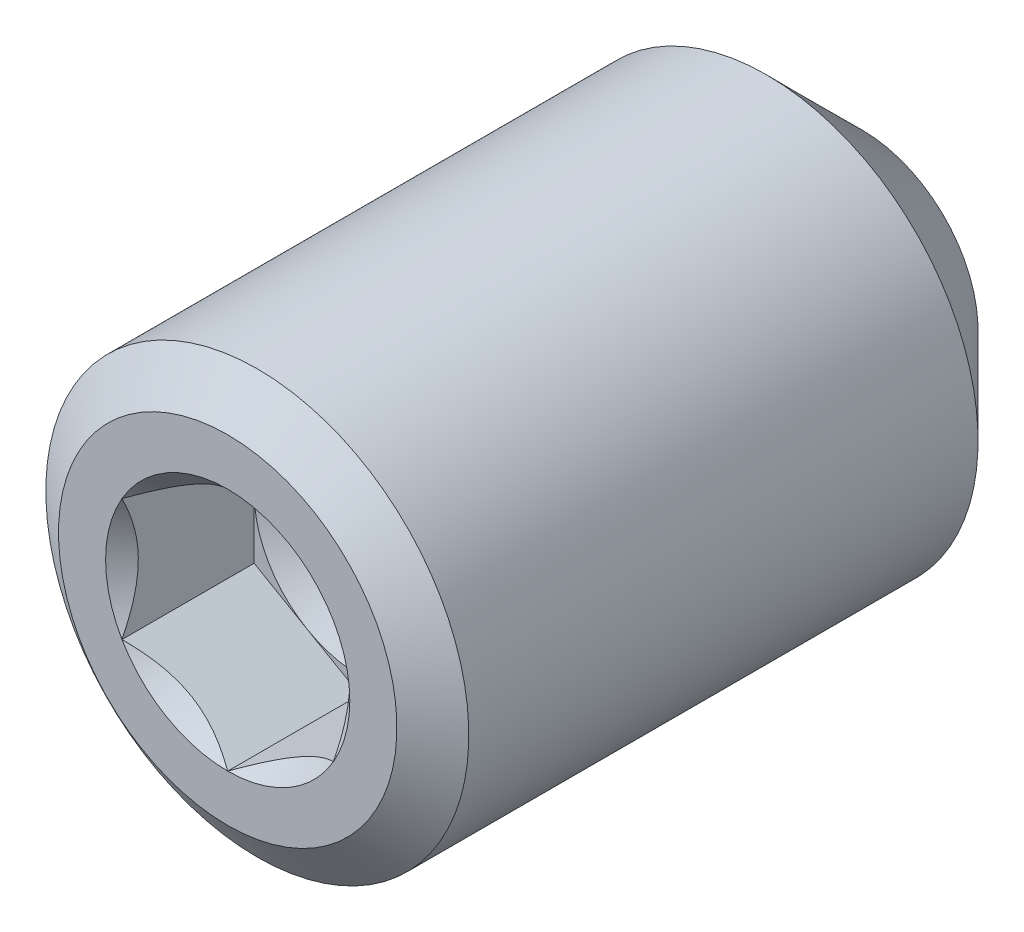
ISO-10303-21;
HEADER;
FILE_DESCRIPTION(('STEP AP214'),'2;1');
FILE_NAME('part.step','',(''),(''),'','','');
FILE_SCHEMA(('AUTOMOTIVE_DESIGN { 1 0 10303 214 1 1 1 1 }'));
ENDSEC;
DATA;
#1=APPLICATION_CONTEXT('core data for automotive mechanical design processes');
#2=APPLICATION_PROTOCOL_DEFINITION('international standard','automotive_design',2000,#1);
#3=PRODUCT_CONTEXT('',#1,'mechanical');
#4=PRODUCT('Part','Part','',(#3));
#5=PRODUCT_RELATED_PRODUCT_CATEGORY('part','',(#4));
#6=PRODUCT_DEFINITION_FORMATION('','',#4);
#7=PRODUCT_DEFINITION_CONTEXT('part definition',#1,'design');
#8=PRODUCT_DEFINITION('design','',#6,#7);
#9=PRODUCT_DEFINITION_SHAPE('','',#8);
#10=(LENGTH_UNIT() NAMED_UNIT(*) SI_UNIT(.MILLI.,.METRE.));
#11=(NAMED_UNIT(*) PLANE_ANGLE_UNIT() SI_UNIT($,.RADIAN.));
#12=(NAMED_UNIT(*) SI_UNIT($,.STERADIAN.) SOLID_ANGLE_UNIT());
#13=UNCERTAINTY_MEASURE_WITH_UNIT(LENGTH_MEASURE(1.E-05),#10,'distance_accuracy_value','');
#14=(GEOMETRIC_REPRESENTATION_CONTEXT(3) GLOBAL_UNCERTAINTY_ASSIGNED_CONTEXT((#13)) GLOBAL_UNIT_ASSIGNED_CONTEXT((#10,
#11,#12)) REPRESENTATION_CONTEXT('',''));
#15=CARTESIAN_POINT('',(0.,0.,0.));
#16=DIRECTION('',(0.,0.,1.));
#17=DIRECTION('',(1.,0.,0.));
#18=AXIS2_PLACEMENT_3D('',#15,#16,#17);
#19=CARTESIAN_POINT('',(-1.5875,2.74963065701559,2.25543977917698));
#20=DIRECTION('',(0.,0.,1.));
#21=DIRECTION('',(1.,0.,0.));
#22=AXIS2_PLACEMENT_3D('',#19,#20,#21);
#23=PLANE('',#22);
#24=CARTESIAN_POINT('',(0.,0.,2.25543977917698));
#25=DIRECTION('',(0.,0.,1.));
#26=DIRECTION('',(1.,0.,0.));
#27=AXIS2_PLACEMENT_3D('',#24,#25,#26);
#28=CIRCLE('',#27,1.5875);
#29=CARTESIAN_POINT('',(1.5875,0.,2.25543977917698));
#30=VERTEX_POINT('',#29);
#31=CARTESIAN_POINT('',(0.79375,1.37481532850779,2.25543977917698));
#32=VERTEX_POINT('',#31);
#33=EDGE_CURVE('E124',#30,#32,#28,.T.);
#34=ORIENTED_EDGE('',*,*,#33,.F.);
#35=DIRECTION('',(0.,1.,0.));
#36=VECTOR('',#35,1.);
#37=CARTESIAN_POINT('',(1.5875,-0.916543552338536,2.25543977917698));
#38=LINE('',#37,#36);
#39=CARTESIAN_POINT('',(1.5875,0.916543552338528,2.25543977917698));
#40=VERTEX_POINT('',#39);
#41=EDGE_CURVE('E150',#30,#40,#38,.T.);
#42=ORIENTED_EDGE('',*,*,#41,.T.);
#43=DIRECTION('',(-0.866025403784439,0.5,0.));
#44=VECTOR('',#43,1.);
#45=CARTESIAN_POINT('',(1.5875,0.916543552338528,2.25543977917698));
#46=LINE('',#45,#44);
#47=EDGE_CURVE('E145',#40,#32,#46,.T.);
#48=ORIENTED_EDGE('',*,*,#47,.T.);
#49=EDGE_LOOP('',(#34,#42,#48));
#50=FACE_BOUND('',#49,.T.);
#51=ADVANCED_FACE('F37',(#50),#23,.T.);
#52=CARTESIAN_POINT('',(-0.79375,1.37481532850779,2.25543977917698));
#53=VERTEX_POINT('',#52);
#54=EDGE_CURVE('E126',#32,#53,#28,.T.);
#55=ORIENTED_EDGE('',*,*,#54,.F.);
#56=CARTESIAN_POINT('',(0.,1.83308710467706,2.25543977917698));
#57=VERTEX_POINT('',#56);
#58=EDGE_CURVE('E137',#32,#57,#46,.T.);
#59=ORIENTED_EDGE('',*,*,#58,.T.);
#60=DIRECTION('',(-0.866025403784439,-0.5,0.));
#61=VECTOR('',#60,1.);
#62=CARTESIAN_POINT('',(0.,1.83308710467706,2.25543977917698));
#63=LINE('',#62,#61);
#64=EDGE_CURVE('E140',#57,#53,#63,.T.);
#65=ORIENTED_EDGE('',*,*,#64,.T.);
#66=EDGE_LOOP('',(#55,#59,#65));
#67=FACE_BOUND('',#66,.T.);
#68=ADVANCED_FACE('F136',(#67),#23,.T.);
#69=CARTESIAN_POINT('',(-1.5875,0.,2.25543977917698));
#70=VERTEX_POINT('',#69);
#71=EDGE_CURVE('E141',#53,#70,#28,.T.);
#72=ORIENTED_EDGE('',*,*,#71,.F.);
#73=CARTESIAN_POINT('',(-1.5875,0.916543552338527,2.25543977917698));
#74=VERTEX_POINT('',#73);
#75=EDGE_CURVE('E152',#53,#74,#63,.T.);
#76=ORIENTED_EDGE('',*,*,#75,.T.);
#77=DIRECTION('',(0.,-1.,0.));
#78=VECTOR('',#77,1.);
#79=CARTESIAN_POINT('',(-1.5875,0.916543552338527,2.25543977917698));
#80=LINE('',#79,#78);
#81=EDGE_CURVE('E163',#74,#70,#80,.T.);
#82=ORIENTED_EDGE('',*,*,#81,.T.);
#83=EDGE_LOOP('',(#72,#76,#82));
#84=FACE_BOUND('',#83,.T.);
#85=ADVANCED_FACE('F238',(#84),#23,.T.);
#86=CARTESIAN_POINT('',(-0.793750000000001,-1.3748153285078,2.25543977917698));
#87=VERTEX_POINT('',#86);
#88=EDGE_CURVE('E264',#70,#87,#28,.T.);
#89=ORIENTED_EDGE('',*,*,#88,.F.);
#90=CARTESIAN_POINT('',(-1.5875,-0.916543552338535,2.25543977917698));
#91=VERTEX_POINT('',#90);
#92=EDGE_CURVE('E162',#70,#91,#80,.T.);
#93=ORIENTED_EDGE('',*,*,#92,.T.);
#94=DIRECTION('',(0.866025403784439,-0.5,0.));
#95=VECTOR('',#94,1.);
#96=CARTESIAN_POINT('',(-1.5875,-0.916543552338535,2.25543977917698));
#97=LINE('',#96,#95);
#98=EDGE_CURVE('E167',#91,#87,#97,.T.);
#99=ORIENTED_EDGE('',*,*,#98,.T.);
#100=EDGE_LOOP('',(#89,#93,#99));
#101=FACE_BOUND('',#100,.T.);
#102=ADVANCED_FACE('F253',(#101),#23,.T.);
#103=CARTESIAN_POINT('',(0.793749999999999,-1.3748153285078,2.25543977917698));
#104=VERTEX_POINT('',#103);
#105=EDGE_CURVE('E58',#87,#104,#28,.T.);
#106=ORIENTED_EDGE('',*,*,#105,.F.);
#107=CARTESIAN_POINT('',(0.,-1.83308710467707,2.25543977917698));
#108=VERTEX_POINT('',#107);
#109=EDGE_CURVE('E166',#87,#108,#97,.T.);
#110=ORIENTED_EDGE('',*,*,#109,.T.);
#111=DIRECTION('',(0.866025403784439,0.5,0.));
#112=VECTOR('',#111,1.);
#113=CARTESIAN_POINT('',(0.,-1.83308710467707,2.25543977917698));
#114=LINE('',#113,#112);
#115=EDGE_CURVE('E171',#108,#104,#114,.T.);
#116=ORIENTED_EDGE('',*,*,#115,.T.);
#117=EDGE_LOOP('',(#106,#110,#116));
#118=FACE_BOUND('',#117,.T.);
#119=ADVANCED_FACE('F243',(#118),#23,.T.);
#120=CARTESIAN_POINT('',(0.,0.,4.23981477917698));
#121=DIRECTION('',(0.,0.,-1.));
#122=DIRECTION('',(0.,1.,0.));
#123=AXIS2_PLACEMENT_3D('',#120,#121,#122);
#124=PLANE('',#123);
#125=CARTESIAN_POINT('',(0.,0.,4.23981477917698));
#126=DIRECTION('',(0.,0.,1.));
#127=DIRECTION('',(1.,0.,0.));
#128=AXIS2_PLACEMENT_3D('',#125,#126,#127);
#129=CIRCLE('',#128,1.83308710467707);
#130=CARTESIAN_POINT('',(0.,1.83308710467706,4.23981477917698));
#131=VERTEX_POINT('',#130);
#132=CARTESIAN_POINT('',(-1.58750000000001,0.916543552338523,4.23981477917698));
#133=VERTEX_POINT('',#132);
#134=EDGE_CURVE('E288',#131,#133,#129,.T.);
#135=ORIENTED_EDGE('',*,*,#134,.F.);
#136=CARTESIAN_POINT('',(1.5875,0.916543552338539,4.23981477917698));
#137=VERTEX_POINT('',#136);
#138=EDGE_CURVE('E289',#137,#131,#129,.T.);
#139=ORIENTED_EDGE('',*,*,#138,.F.);
#140=CARTESIAN_POINT('',(1.58750000000001,-0.91654355233853,4.23981477917698));
#141=VERTEX_POINT('',#140);
#142=EDGE_CURVE('E65',#141,#137,#129,.T.);
#143=ORIENTED_EDGE('',*,*,#142,.F.);
#144=CARTESIAN_POINT('',(0.,-1.83308710467707,4.23981477917698));
#145=VERTEX_POINT('',#144);
#146=EDGE_CURVE('E284',#145,#141,#129,.T.);
#147=ORIENTED_EDGE('',*,*,#146,.F.);
#148=CARTESIAN_POINT('',(-1.5875,-0.916543552338545,4.23981477917698));
#149=VERTEX_POINT('',#148);
#150=EDGE_CURVE('E281',#149,#145,#129,.T.);
#151=ORIENTED_EDGE('',*,*,#150,.F.);
#152=EDGE_CURVE('E283',#133,#149,#129,.T.);
#153=ORIENTED_EDGE('',*,*,#152,.F.);
#154=EDGE_LOOP('',(#135,#139,#143,#147,#151,#153));
#155=FACE_BOUND('',#154,.T.);
#156=CARTESIAN_POINT('',(0.,0.,4.23981477917698));
#157=DIRECTION('',(0.,0.,1.));
#158=DIRECTION('',(0.,-1.,0.));
#159=AXIS2_PLACEMENT_3D('',#156,#157,#158);
#160=CIRCLE('',#159,2.54);
#161=CARTESIAN_POINT('',(0.,-2.54000000000001,4.23981477917697));
#162=VERTEX_POINT('',#161);
#163=EDGE_CURVE('E51',#162,#162,#160,.T.);
#164=ORIENTED_EDGE('',*,*,#163,.T.);
#165=EDGE_LOOP('',(#164));
#166=FACE_BOUND('',#165,.T.);
#167=ADVANCED_FACE('F39',(#155,#166),#124,.F.);
#168=CARTESIAN_POINT('',(0.,0.,3.79518299241381));
#169=DIRECTION('',(0.,0.,-1.));
#170=DIRECTION('',(0.,1.,0.));
#171=AXIS2_PLACEMENT_3D('',#168,#169,#170);
#172=CONICAL_SURFACE('',#171,3.175,0.95993108859688);
#173=ORIENTED_EDGE('',*,*,#163,.F.);
#174=EDGE_LOOP('',(#173));
#175=FACE_BOUND('',#174,.T.);
#176=CARTESIAN_POINT('',(0.,0.,3.79518299241381));
#177=DIRECTION('',(0.,0.,1.));
#178=DIRECTION('',(0.,-1.,0.));
#179=AXIS2_PLACEMENT_3D('',#176,#177,#178);
#180=CIRCLE('',#179,3.175);
#181=CARTESIAN_POINT('',(0.,-3.17500000000001,3.79518299241381));
#182=VERTEX_POINT('',#181);
#183=EDGE_CURVE('E198',#182,#182,#180,.T.);
#184=ORIENTED_EDGE('',*,*,#183,.T.);
#185=EDGE_LOOP('',(#184));
#186=FACE_BOUND('',#185,.T.);
#187=ADVANCED_FACE('F204',(#175,#186),#172,.T.);
#188=CARTESIAN_POINT('',(0.,0.,-4.23981477917698));
#189=DIRECTION('',(0.,0.,1.));
#190=DIRECTION('',(0.,-1.,0.));
#191=AXIS2_PLACEMENT_3D('',#188,#189,#190);
#192=CYLINDRICAL_SURFACE('',#191,3.175);
#193=ORIENTED_EDGE('',*,*,#183,.F.);
#194=EDGE_LOOP('',(#193));
#195=FACE_BOUND('',#194,.T.);
#196=CARTESIAN_POINT('',(0.,0.,-3.84997379831027));
#197=DIRECTION('',(0.,0.,1.));
#198=DIRECTION('',(0.,-1.,0.));
#199=AXIS2_PLACEMENT_3D('',#196,#197,#198);
#200=CIRCLE('',#199,3.175);
#201=CARTESIAN_POINT('',(0.,-3.175,-3.84997379831027));
#202=VERTEX_POINT('',#201);
#203=EDGE_CURVE('E195',#202,#202,#200,.T.);
#204=ORIENTED_EDGE('',*,*,#203,.T.);
#205=EDGE_LOOP('',(#204));
#206=FACE_BOUND('',#205,.T.);
#207=ADVANCED_FACE('F207',(#195,#206),#192,.T.);
#208=CARTESIAN_POINT('',(0.,0.,-5.28518522082302));
#209=DIRECTION('',(0.,0.,1.));
#210=DIRECTION('',(0.,-1.,0.));
#211=AXIS2_PLACEMENT_3D('',#208,#209,#210);
#212=CONICAL_SURFACE('',#211,1.73978857748722,0.785398163397456);
#213=ORIENTED_EDGE('',*,*,#203,.F.);
#214=EDGE_LOOP('',(#213));
#215=FACE_BOUND('',#214,.T.);
#216=CARTESIAN_POINT('',(0.,0.,-5.28518522082302));
#217=DIRECTION('',(0.,0.,1.));
#218=DIRECTION('',(0.,-1.,0.));
#219=AXIS2_PLACEMENT_3D('',#216,#217,#218);
#220=CIRCLE('',#219,1.73978857748722);
#221=CARTESIAN_POINT('',(0.,-1.73978857748722,-5.28518522082303));
#222=VERTEX_POINT('',#221);
#223=EDGE_CURVE('E179',#222,#222,#220,.T.);
#224=ORIENTED_EDGE('',*,*,#223,.T.);
#225=EDGE_LOOP('',(#224));
#226=FACE_BOUND('',#225,.T.);
#227=ADVANCED_FACE('F212',(#215,#226),#212,.T.);
#228=CARTESIAN_POINT('',(0.,0.,-4.23981477917698));
#229=DIRECTION('',(0.,0.,-1.));
#230=DIRECTION('',(0.,1.,0.));
#231=AXIS2_PLACEMENT_3D('',#228,#229,#230);
#232=CONICAL_SURFACE('',#231,0.,1.02974425867666);
#233=ORIENTED_EDGE('',*,*,#223,.F.);
#234=EDGE_LOOP('',(#233));
#235=FACE_BOUND('',#234,.T.);
#236=CARTESIAN_POINT('',(0.,0.,-4.23981477917698));
#237=VERTEX_POINT('',#236);
#238=VERTEX_LOOP('',#237);
#239=FACE_BOUND('',#238,.T.);
#240=ADVANCED_FACE('F218',(#235,#239),#232,.F.);
#241=CARTESIAN_POINT('',(0.,0.,4.23981477917698));
#242=DIRECTION('',(0.,0.,1.));
#243=DIRECTION('',(1.,0.,0.));
#244=AXIS2_PLACEMENT_3D('',#241,#242,#243);
#245=CONICAL_SURFACE('',#244,1.83308710467707,0.78539816339745);
#246=ORIENTED_EDGE('',*,*,#134,.T.);
#247=CARTESIAN_POINT('',(0.000200000000000358,1.8332025747309,4.23993026014068));
#248=CARTESIAN_POINT('',(-0.0543752080991361,1.80169356364378,4.20844558754757));
#249=CARTESIAN_POINT('',(-0.10986303679029,1.76965765081219,4.1788098251905));
#250=CARTESIAN_POINT('',(-0.223009120846358,1.70433272872467,4.1245470391978));
#251=CARTESIAN_POINT('',(-0.28067814112938,1.67103750434037,4.09995021431015));
#252=CARTESIAN_POINT('',(-0.396965021873103,1.60389924243976,4.05781514344955));
#253=CARTESIAN_POINT('',(-0.45555325525593,1.57007331012484,4.04017097190679));
#254=CARTESIAN_POINT('',(-0.57401977325443,1.50167663406844,4.01298624926194));
#255=CARTESIAN_POINT('',(-0.633894437016104,1.467107980828,4.00342539987205));
#256=CARTESIAN_POINT('',(-0.737081228123442,1.40753305920537,3.99479919228098));
#257=CARTESIAN_POINT('',(-0.780259984047712,1.38260379284922,3.99352197198655));
#258=CARTESIAN_POINT('',(-0.866546961464601,1.33278598321002,3.99567183499168));
#259=CARTESIAN_POINT('',(-0.909655152921387,1.30789745726817,3.99910056772632));
#260=CARTESIAN_POINT('',(-0.995453664997969,1.25836166322468,4.01046577361032));
#261=CARTESIAN_POINT('',(-1.03814359107459,1.23371462291266,4.01840615097861));
#262=CARTESIAN_POINT('',(-1.12280693652164,1.18483421762831,4.03836319362807));
#263=CARTESIAN_POINT('',(-1.16478004024492,1.16060103489495,4.05038160838566));
#264=CARTESIAN_POINT('',(-1.27228854188643,1.09853097253205,4.08606167642422));
#265=CARTESIAN_POINT('',(-1.3371572282911,1.06107901897434,4.11241335148011));
#266=CARTESIAN_POINT('',(-1.43253840061908,1.00601067345516,4.15689831602867));
#267=CARTESIAN_POINT('',(-1.46396930046384,0.987864034968911,4.1725276369781));
#268=CARTESIAN_POINT('',(-1.52625301443036,0.951904515944211,4.20521326703807));
#269=CARTESIAN_POINT('',(-1.55710609603942,0.93409148097189,4.22226889483394));
#270=CARTESIAN_POINT('',(-1.5877,0.91642808228469,4.23993026014068));
#271=B_SPLINE_CURVE_WITH_KNOTS('',3,(#247,#248,#249,#250,#251,#252,#253,#254,#255,#256,#257,
#258,#259,#260,#261,#262,#263,#264,#265,#266,#267,#268,#269,#270),.UNSPECIFIED.,.F.,.F.,(4,2,2,
2,2,2,2,2,2,2,2,4),(0.,0.211482650810816,0.424197870807275,0.633533884524815,0.842342653263348,
0.991755553727141,1.14122083674204,1.29081565918877,1.44047473906438,1.6781878086972,
1.79671410024894,1.91518409436631),.UNSPECIFIED.);
#272=EDGE_CURVE('E11',#131,#133,#271,.T.);
#273=ORIENTED_EDGE('',*,*,#272,.F.);
#274=EDGE_LOOP('',(#246,#273));
#275=FACE_BOUND('',#274,.T.);
#276=ADVANCED_FACE('F224',(#275),#245,.F.);
#277=ORIENTED_EDGE('',*,*,#152,.T.);
#278=CARTESIAN_POINT('',(-1.5875,-1.82796193752854,4.82780204243103));
#279=CARTESIAN_POINT('',(-1.5875,-1.78345227640909,4.79420143185249));
#280=CARTESIAN_POINT('',(-1.5875,-1.73869460884115,4.76093027447514));
#281=CARTESIAN_POINT('',(-1.5875,-1.64858256619969,4.69518289701079));
#282=CARTESIAN_POINT('',(-1.5875,-1.60322804415398,4.66270687857516));
#283=CARTESIAN_POINT('',(-1.5875,-1.46545441997288,4.56621239130148));
#284=CARTESIAN_POINT('',(-1.5875,-1.37200191361453,4.50364494276068));
#285=CARTESIAN_POINT('',(-1.5875,-1.17603565005265,4.380817583704));
#286=CARTESIAN_POINT('',(-1.5875,-1.0733091548238,4.32089322891198));
#287=CARTESIAN_POINT('',(-1.5875,-0.862725191180893,4.21127881189576));
#288=CARTESIAN_POINT('',(-1.5875,-0.754886591703737,4.16155424817407));
#289=CARTESIAN_POINT('',(-1.5875,-0.5930199118769,4.10072085328819));
#290=CARTESIAN_POINT('',(-1.5875,-0.541388282021832,4.08326123124238));
#291=CARTESIAN_POINT('',(-1.5875,-0.436878539726307,4.05248714704655));
#292=CARTESIAN_POINT('',(-1.5875,-0.384000341684466,4.03917297045991));
#293=CARTESIAN_POINT('',(-1.5875,-0.27819692428028,4.01760308466663));
#294=CARTESIAN_POINT('',(-1.5875,-0.225289653887533,4.00926070718178));
#295=CARTESIAN_POINT('',(-1.5875,-0.118909299564336,3.99779729688668));
#296=CARTESIAN_POINT('',(-1.5875,-0.0654363144870872,3.9946753665373));
#297=CARTESIAN_POINT('',(-1.5875,0.0396125416393595,3.99388442026585));
#298=CARTESIAN_POINT('',(-1.5875,0.091187023477685,3.99602212218456));
#299=CARTESIAN_POINT('',(-1.5875,0.19389400898613,4.00520614764102));
#300=CARTESIAN_POINT('',(-1.5875,0.245026469231594,4.01225294802803));
#301=CARTESIAN_POINT('',(-1.5875,0.347344844708743,4.03098999583787));
#302=CARTESIAN_POINT('',(-1.5875,0.398516068757361,4.04275926271575));
#303=CARTESIAN_POINT('',(-1.5875,0.499740445944842,4.07031572565794));
#304=CARTESIAN_POINT('',(-1.5875,0.549793692255947,4.08610258552681));
#305=CARTESIAN_POINT('',(-1.5875,0.707380773963355,4.14174455739328));
#306=CARTESIAN_POINT('',(-1.5875,0.812671633972069,4.18793664163491));
#307=CARTESIAN_POINT('',(-1.5875,1.01830702525798,4.29063911494773));
#308=CARTESIAN_POINT('',(-1.5875,1.11863208590429,4.34718657452642));
#309=CARTESIAN_POINT('',(-1.5875,1.31036772781772,4.46384897228734));
#310=CARTESIAN_POINT('',(-1.5875,1.40197355431624,4.52364699496134));
#311=CARTESIAN_POINT('',(-1.5875,1.53693633902,4.6160885813521));
#312=CARTESIAN_POINT('',(-1.5875,1.58134147295665,4.64722840677096));
#313=CARTESIAN_POINT('',(-1.5875,1.66954488801524,4.7103315985783));
#314=CARTESIAN_POINT('',(-1.5875,1.7133433326628,4.74229473613916));
#315=CARTESIAN_POINT('',(-1.5875,1.75688919183915,4.77459926780923));
#316=B_SPLINE_CURVE_WITH_KNOTS('',3,(#278,#279,#280,#281,#282,#283,#284,#285,#286,#287,#288,
#289,#290,#291,#292,#293,#294,#295,#296,#297,#298,#299,#300,#301,#302,#303,#304,#305,#306,#307,
#308,#309,#310,#311,#312,#313,#314,#315),.UNSPECIFIED.,.F.,.F.,(4,2,2,2,2,2,2,2,2,2,2,2,2,2,2,2,
2,2,4),(0.,0.167300856038501,0.334643709948953,0.671883358487459,1.0283722463923,
1.38363464368218,1.5470077555167,1.71039211899209,1.87083807359551,2.03125644026828,
2.18586834465336,2.34049526948591,2.49782525419329,2.65514207772674,2.99906299923216,
3.34424006214767,3.67226428551495,3.83496498281157,3.99762093763059),.UNSPECIFIED.);
#317=EDGE_CURVE('E275',#133,#149,#316,.F.);
#318=ORIENTED_EDGE('',*,*,#317,.F.);
#319=EDGE_LOOP('',(#277,#318));
#320=FACE_BOUND('',#319,.T.);
#321=ADVANCED_FACE('F229',(#320),#245,.F.);
#322=ORIENTED_EDGE('',*,*,#150,.T.);
#323=CARTESIAN_POINT('',(-1.5877,-0.916428082284697,4.23993026014068));
#324=CARTESIAN_POINT('',(-1.53312479190086,-0.947937093371813,4.20844558754757));
#325=CARTESIAN_POINT('',(-1.47763696320971,-0.979973006203399,4.1788098251905));
#326=CARTESIAN_POINT('',(-1.36449087915364,-1.04529792829092,4.1245470391978));
#327=CARTESIAN_POINT('',(-1.30682185887062,-1.07859315267523,4.09995021431015));
#328=CARTESIAN_POINT('',(-1.1905349781269,-1.14573141457584,4.05781514344955));
#329=CARTESIAN_POINT('',(-1.13194674474407,-1.17955734689076,4.04017097190679));
#330=CARTESIAN_POINT('',(-1.01348022674557,-1.24795402294715,4.01298624926194));
#331=CARTESIAN_POINT('',(-0.953605562983896,-1.28252267618759,4.00342539987205));
#332=CARTESIAN_POINT('',(-0.850418771876558,-1.34209759781022,3.99479919228098));
#333=CARTESIAN_POINT('',(-0.807240015952288,-1.36702686416637,3.99352197198655));
#334=CARTESIAN_POINT('',(-0.720953038535399,-1.41684467380557,3.99567183499168));
#335=CARTESIAN_POINT('',(-0.677844847078612,-1.44173319974743,3.99910056772632));
#336=CARTESIAN_POINT('',(-0.592046335002031,-1.49126899379091,4.01046577361032));
#337=CARTESIAN_POINT('',(-0.549356408925407,-1.51591603410294,4.01840615097861));
#338=CARTESIAN_POINT('',(-0.464693063478359,-1.56479643938728,4.03836319362807));
#339=CARTESIAN_POINT('',(-0.422719959755075,-1.58902962212065,4.05038160838566));
#340=CARTESIAN_POINT('',(-0.315211458113567,-1.65109968448354,4.08606167642422));
#341=CARTESIAN_POINT('',(-0.250342771708901,-1.68855163804126,4.11241335148011));
#342=CARTESIAN_POINT('',(-0.154961599380925,-1.74361998356043,4.15689831602867));
#343=CARTESIAN_POINT('',(-0.123530699536158,-1.76176662204668,4.1725276369781));
#344=CARTESIAN_POINT('',(-0.0612469855696382,-1.79772614107138,4.20521326703807));
#345=CARTESIAN_POINT('',(-0.0303939039605777,-1.8155391760437,4.22226889483394));
#346=CARTESIAN_POINT('',(0.000199999999999145,-1.8332025747309,4.23993026014068));
#347=B_SPLINE_CURVE_WITH_KNOTS('',3,(#323,#324,#325,#326,#327,#328,#329,#330,#331,#332,#333,
#334,#335,#336,#337,#338,#339,#340,#341,#342,#343,#344,#345,#346),.UNSPECIFIED.,.F.,.F.,(4,2,2,
2,2,2,2,2,2,2,2,4),(0.,0.211482650810816,0.424197870807276,0.633533884524815,0.842342653263348,
0.991755553727141,1.14122083674204,1.29081565918877,1.44047473906438,1.6781878086972,
1.79671410024894,1.91518409436631),.UNSPECIFIED.);
#348=EDGE_CURVE('E278',#149,#145,#347,.T.);
#349=ORIENTED_EDGE('',*,*,#348,.F.);
#350=EDGE_LOOP('',(#322,#349));
#351=FACE_BOUND('',#350,.T.);
#352=ADVANCED_FACE('F437',(#351),#245,.F.);
#353=ORIENTED_EDGE('',*,*,#146,.T.);
#354=CARTESIAN_POINT('',(-0.000200000000000624,-1.8332025747309,4.23993026014068));
#355=CARTESIAN_POINT('',(0.054375208099136,-1.80169356364379,4.20844558754757));
#356=CARTESIAN_POINT('',(0.109863036790289,-1.7696576508122,4.1788098251905));
#357=CARTESIAN_POINT('',(0.223009120846358,-1.70433272872468,4.1245470391978));
#358=CARTESIAN_POINT('',(0.28067814112938,-1.67103750434037,4.09995021431015));
#359=CARTESIAN_POINT('',(0.396965021873102,-1.60389924243976,4.05781514344955));
#360=CARTESIAN_POINT('',(0.45555325525593,-1.57007331012484,4.04017097190679));
#361=CARTESIAN_POINT('',(0.57401977325443,-1.50167663406845,4.01298624926194));
#362=CARTESIAN_POINT('',(0.633894437016104,-1.46710798082801,4.00342539987205));
#363=CARTESIAN_POINT('',(0.737081228123441,-1.40753305920538,3.99479919228098));
#364=CARTESIAN_POINT('',(0.780259984047711,-1.38260379284923,3.99352197198655));
#365=CARTESIAN_POINT('',(0.8665469614646,-1.33278598321003,3.99567183499168));
#366=CARTESIAN_POINT('',(0.909655152921386,-1.30789745726817,3.99910056772632));
#367=CARTESIAN_POINT('',(0.995453664997968,-1.25836166322469,4.01046577361032));
#368=CARTESIAN_POINT('',(1.03814359107459,-1.23371462291267,4.01840615097861));
#369=CARTESIAN_POINT('',(1.12280693652164,-1.18483421762832,4.03836319362807));
#370=CARTESIAN_POINT('',(1.16478004024492,-1.16060103489496,4.05038160838566));
#371=CARTESIAN_POINT('',(1.27228854188643,-1.09853097253206,4.08606167642422));
#372=CARTESIAN_POINT('',(1.3371572282911,-1.06107901897435,4.11241335148011));
#373=CARTESIAN_POINT('',(1.43253840061907,-1.00601067345517,4.15689831602867));
#374=CARTESIAN_POINT('',(1.46396930046384,-0.987864034968919,4.1725276369781));
#375=CARTESIAN_POINT('',(1.52625301443036,-0.951904515944219,4.20521326703807));
#376=CARTESIAN_POINT('',(1.55710609603942,-0.934091480971898,4.22226889483394));
#377=CARTESIAN_POINT('',(1.5877,-0.916428082284698,4.23993026014068));
#378=B_SPLINE_CURVE_WITH_KNOTS('',3,(#354,#355,#356,#357,#358,#359,#360,#361,#362,#363,#364,
#365,#366,#367,#368,#369,#370,#371,#372,#373,#374,#375,#376,#377),.UNSPECIFIED.,.F.,.F.,(4,2,2,
2,2,2,2,2,2,2,2,4),(0.,0.211482650810817,0.424197870807276,0.633533884524815,0.842342653263347,
0.99175555372714,1.14122083674204,1.29081565918877,1.44047473906437,1.6781878086972,
1.79671410024894,1.91518409436631),.UNSPECIFIED.);
#379=EDGE_CURVE('E330',#145,#141,#378,.T.);
#380=ORIENTED_EDGE('',*,*,#379,.F.);
#381=EDGE_LOOP('',(#353,#380));
#382=FACE_BOUND('',#381,.T.);
#383=ADVANCED_FACE('F429',(#382),#245,.F.);
#384=ORIENTED_EDGE('',*,*,#142,.T.);
#385=CARTESIAN_POINT('',(1.5875,-1.82796193752854,4.82780204243103));
#386=CARTESIAN_POINT('',(1.5875,-1.78345227640909,4.79420143185249));
#387=CARTESIAN_POINT('',(1.5875,-1.73869460884115,4.76093027447514));
#388=CARTESIAN_POINT('',(1.5875,-1.64858256619969,4.69518289701079));
#389=CARTESIAN_POINT('',(1.5875,-1.60322804415398,4.66270687857516));
#390=CARTESIAN_POINT('',(1.5875,-1.46545441997288,4.56621239130148));
#391=CARTESIAN_POINT('',(1.5875,-1.37200191361453,4.50364494276068));
#392=CARTESIAN_POINT('',(1.5875,-1.17603565005265,4.380817583704));
#393=CARTESIAN_POINT('',(1.5875,-1.0733091548238,4.32089322891198));
#394=CARTESIAN_POINT('',(1.5875,-0.862725191180894,4.21127881189576));
#395=CARTESIAN_POINT('',(1.5875,-0.754886591703737,4.16155424817407));
#396=CARTESIAN_POINT('',(1.5875,-0.593019911876901,4.10072085328819));
#397=CARTESIAN_POINT('',(1.5875,-0.541388282021833,4.08326123124238));
#398=CARTESIAN_POINT('',(1.5875,-0.436878539726308,4.05248714704655));
#399=CARTESIAN_POINT('',(1.5875,-0.384000341684467,4.03917297045991));
#400=CARTESIAN_POINT('',(1.5875,-0.27819692428028,4.01760308466663));
#401=CARTESIAN_POINT('',(1.5875,-0.225289653887534,4.00926070718178));
#402=CARTESIAN_POINT('',(1.5875,-0.118909299564337,3.99779729688668));
#403=CARTESIAN_POINT('',(1.5875,-0.0654363144870882,3.9946753665373));
#404=CARTESIAN_POINT('',(1.5875,0.0396125416393586,3.99388442026585));
#405=CARTESIAN_POINT('',(1.5875,0.0911870234776841,3.99602212218456));
#406=CARTESIAN_POINT('',(1.5875,0.193894008986129,4.00520614764102));
#407=CARTESIAN_POINT('',(1.5875,0.245026469231593,4.01225294802803));
#408=CARTESIAN_POINT('',(1.5875,0.347344844708742,4.03098999583787));
#409=CARTESIAN_POINT('',(1.5875,0.39851606875736,4.04275926271575));
#410=CARTESIAN_POINT('',(1.5875,0.499740445944841,4.07031572565794));
#411=CARTESIAN_POINT('',(1.5875,0.549793692255946,4.08610258552681));
#412=CARTESIAN_POINT('',(1.5875,0.707380773963354,4.14174455739328));
#413=CARTESIAN_POINT('',(1.5875,0.812671633972068,4.18793664163491));
#414=CARTESIAN_POINT('',(1.5875,1.01830702525798,4.29063911494772));
#415=CARTESIAN_POINT('',(1.5875,1.11863208590429,4.34718657452642));
#416=CARTESIAN_POINT('',(1.5875,1.31036772781772,4.46384897228734));
#417=CARTESIAN_POINT('',(1.5875,1.40197355431623,4.52364699496134));
#418=CARTESIAN_POINT('',(1.5875,1.53693633902,4.6160885813521));
#419=CARTESIAN_POINT('',(1.5875,1.58134147295665,4.64722840677096));
#420=CARTESIAN_POINT('',(1.5875,1.66954488801523,4.71033159857829));
#421=CARTESIAN_POINT('',(1.5875,1.7133433326628,4.74229473613916));
#422=CARTESIAN_POINT('',(1.5875,1.75688919183915,4.77459926780923));
#423=B_SPLINE_CURVE_WITH_KNOTS('',3,(#385,#386,#387,#388,#389,#390,#391,#392,#393,#394,#395,
#396,#397,#398,#399,#400,#401,#402,#403,#404,#405,#406,#407,#408,#409,#410,#411,#412,#413,#414,
#415,#416,#417,#418,#419,#420,#421,#422),.UNSPECIFIED.,.F.,.F.,(4,2,2,2,2,2,2,2,2,2,2,2,2,2,2,2,
2,2,4),(0.,0.167300856038501,0.334643709948953,0.671883358487459,1.0283722463923,
1.38363464368218,1.5470077555167,1.71039211899209,1.87083807359551,2.03125644026828,
2.18586834465336,2.34049526948591,2.49782525419329,2.65514207772674,2.99906299923216,
3.34424006214767,3.67226428551495,3.83496498281157,3.99762093763059),.UNSPECIFIED.);
#424=EDGE_CURVE('E324',#141,#137,#423,.T.);
#425=ORIENTED_EDGE('',*,*,#424,.F.);
#426=EDGE_LOOP('',(#384,#425));
#427=FACE_BOUND('',#426,.T.);
#428=ADVANCED_FACE('F250',(#427),#245,.F.);
#429=ORIENTED_EDGE('',*,*,#138,.T.);
#430=CARTESIAN_POINT('',(1.5877,0.91642808228469,4.23993026014068));
#431=CARTESIAN_POINT('',(1.53312479190086,0.947937093371806,4.20844558754757));
#432=CARTESIAN_POINT('',(1.47763696320971,0.979973006203391,4.1788098251905));
#433=CARTESIAN_POINT('',(1.36449087915364,1.04529792829091,4.1245470391978));
#434=CARTESIAN_POINT('',(1.30682185887062,1.07859315267522,4.09995021431015));
#435=CARTESIAN_POINT('',(1.1905349781269,1.14573141457583,4.05781514344955));
#436=CARTESIAN_POINT('',(1.13194674474407,1.17955734689075,4.04017097190679));
#437=CARTESIAN_POINT('',(1.01348022674557,1.24795402294714,4.01298624926194));
#438=CARTESIAN_POINT('',(0.953605562983896,1.28252267618758,4.00342539987205));
#439=CARTESIAN_POINT('',(0.850418771876559,1.34209759781022,3.99479919228098));
#440=CARTESIAN_POINT('',(0.807240015952289,1.36702686416637,3.99352197198655));
#441=CARTESIAN_POINT('',(0.7209530385354,1.41684467380557,3.99567183499168));
#442=CARTESIAN_POINT('',(0.677844847078613,1.44173319974742,3.99910056772632));
#443=CARTESIAN_POINT('',(0.592046335002032,1.4912689937909,4.01046577361032));
#444=CARTESIAN_POINT('',(0.549356408925407,1.51591603410293,4.01840615097861));
#445=CARTESIAN_POINT('',(0.46469306347836,1.56479643938728,4.03836319362807));
#446=CARTESIAN_POINT('',(0.422719959755076,1.58902962212064,4.05038160838566));
#447=CARTESIAN_POINT('',(0.315211458113567,1.65109968448354,4.08606167642422));
#448=CARTESIAN_POINT('',(0.250342771708901,1.68855163804125,4.11241335148011));
#449=CARTESIAN_POINT('',(0.154961599380925,1.74361998356043,4.15689831602867));
#450=CARTESIAN_POINT('',(0.123530699536158,1.76176662204667,4.1725276369781));
#451=CARTESIAN_POINT('',(0.0612469855696379,1.79772614107137,4.20521326703807));
#452=CARTESIAN_POINT('',(0.0303939039605773,1.8155391760437,4.22226889483394));
#453=CARTESIAN_POINT('',(-0.000199999999999747,1.8332025747309,4.23993026014068));
#454=B_SPLINE_CURVE_WITH_KNOTS('',3,(#430,#431,#432,#433,#434,#435,#436,#437,#438,#439,#440,
#441,#442,#443,#444,#445,#446,#447,#448,#449,#450,#451,#452,#453),.UNSPECIFIED.,.F.,.F.,(4,2,2,
2,2,2,2,2,2,2,2,4),(0.,0.211482650810816,0.424197870807275,0.633533884524814,0.842342653263346,
0.991755553727139,1.14122083674204,1.29081565918877,1.44047473906437,1.6781878086972,
1.79671410024894,1.91518409436631),.UNSPECIFIED.);
#455=EDGE_CURVE('E148',#137,#131,#454,.T.);
#456=ORIENTED_EDGE('',*,*,#455,.F.);
#457=EDGE_LOOP('',(#429,#456));
#458=FACE_BOUND('',#457,.T.);
#459=ADVANCED_FACE('F231',(#458),#245,.F.);
#460=EDGE_CURVE('E128',#104,#30,#28,.T.);
#461=ORIENTED_EDGE('',*,*,#460,.F.);
#462=CARTESIAN_POINT('',(1.5875,-0.916543552338536,2.25543977917698));
#463=VERTEX_POINT('',#462);
#464=EDGE_CURVE('E170',#104,#463,#114,.T.);
#465=ORIENTED_EDGE('',*,*,#464,.T.);
#466=EDGE_CURVE('E174',#463,#30,#38,.T.);
#467=ORIENTED_EDGE('',*,*,#466,.T.);
#468=EDGE_LOOP('',(#461,#465,#467));
#469=FACE_BOUND('',#468,.T.);
#470=ADVANCED_FACE('F234',(#469),#23,.T.);
#471=CARTESIAN_POINT('',(0.,1.83308710467706,2.25543977917698));
#472=DIRECTION('',(-0.5,0.866025403784439,0.));
#473=DIRECTION('',(-0.866025403784439,-0.5,0.));
#474=AXIS2_PLACEMENT_3D('',#471,#472,#473);
#475=PLANE('',#474);
#476=DIRECTION('',(0.,0.,1.));
#477=VECTOR('',#476,1.);
#478=CARTESIAN_POINT('',(0.,1.83308710467706,2.25543977917698));
#479=LINE('',#478,#477);
#480=EDGE_CURVE('E147',#57,#131,#479,.T.);
#481=ORIENTED_EDGE('',*,*,#480,.T.);
#482=ORIENTED_EDGE('',*,*,#272,.T.);
#483=DIRECTION('',(0.,0.,1.));
#484=VECTOR('',#483,1.);
#485=CARTESIAN_POINT('',(-1.5875,0.916543552338527,2.25543977917698));
#486=LINE('',#485,#484);
#487=EDGE_CURVE('E189',#74,#133,#486,.T.);
#488=ORIENTED_EDGE('',*,*,#487,.F.);
#489=ORIENTED_EDGE('',*,*,#75,.F.);
#490=ORIENTED_EDGE('',*,*,#64,.F.);
#491=EDGE_LOOP('',(#481,#482,#488,#489,#490));
#492=FACE_BOUND('',#491,.T.);
#493=ADVANCED_FACE('F241',(#492),#475,.F.);
#494=CARTESIAN_POINT('',(-1.5875,0.916543552338527,2.25543977917698));
#495=DIRECTION('',(-1.,0.,0.));
#496=DIRECTION('',(0.,-1.,0.));
#497=AXIS2_PLACEMENT_3D('',#494,#495,#496);
#498=PLANE('',#497);
#499=ORIENTED_EDGE('',*,*,#487,.T.);
#500=ORIENTED_EDGE('',*,*,#317,.T.);
#501=DIRECTION('',(0.,0.,1.));
#502=VECTOR('',#501,1.);
#503=CARTESIAN_POINT('',(-1.5875,-0.916543552338535,2.25543977917698));
#504=LINE('',#503,#502);
#505=EDGE_CURVE('E186',#91,#149,#504,.T.);
#506=ORIENTED_EDGE('',*,*,#505,.F.);
#507=ORIENTED_EDGE('',*,*,#92,.F.);
#508=ORIENTED_EDGE('',*,*,#81,.F.);
#509=EDGE_LOOP('',(#499,#500,#506,#507,#508));
#510=FACE_BOUND('',#509,.T.);
#511=ADVANCED_FACE('F248',(#510),#498,.F.);
#512=CARTESIAN_POINT('',(-1.5875,-0.916543552338535,2.25543977917698));
#513=DIRECTION('',(-0.5,-0.866025403784439,0.));
#514=DIRECTION('',(0.866025403784439,-0.5,0.));
#515=AXIS2_PLACEMENT_3D('',#512,#513,#514);
#516=PLANE('',#515);
#517=ORIENTED_EDGE('',*,*,#505,.T.);
#518=ORIENTED_EDGE('',*,*,#348,.T.);
#519=DIRECTION('',(0.,0.,1.));
#520=VECTOR('',#519,1.);
#521=CARTESIAN_POINT('',(0.,-1.83308710467707,2.25543977917698));
#522=LINE('',#521,#520);
#523=EDGE_CURVE('E183',#108,#145,#522,.T.);
#524=ORIENTED_EDGE('',*,*,#523,.F.);
#525=ORIENTED_EDGE('',*,*,#109,.F.);
#526=ORIENTED_EDGE('',*,*,#98,.F.);
#527=EDGE_LOOP('',(#517,#518,#524,#525,#526));
#528=FACE_BOUND('',#527,.T.);
#529=ADVANCED_FACE('F267',(#528),#516,.F.);
#530=CARTESIAN_POINT('',(0.,-1.83308710467707,2.25543977917698));
#531=DIRECTION('',(0.5,-0.866025403784439,0.));
#532=DIRECTION('',(0.866025403784439,0.5,0.));
#533=AXIS2_PLACEMENT_3D('',#530,#531,#532);
#534=PLANE('',#533);
#535=ORIENTED_EDGE('',*,*,#523,.T.);
#536=ORIENTED_EDGE('',*,*,#379,.T.);
#537=DIRECTION('',(0.,0.,1.));
#538=VECTOR('',#537,1.);
#539=CARTESIAN_POINT('',(1.5875,-0.916543552338536,2.25543977917698));
#540=LINE('',#539,#538);
#541=EDGE_CURVE('E180',#463,#141,#540,.T.);
#542=ORIENTED_EDGE('',*,*,#541,.F.);
#543=ORIENTED_EDGE('',*,*,#464,.F.);
#544=ORIENTED_EDGE('',*,*,#115,.F.);
#545=EDGE_LOOP('',(#535,#536,#542,#543,#544));
#546=FACE_BOUND('',#545,.T.);
#547=ADVANCED_FACE('F316',(#546),#534,.F.);
#548=CARTESIAN_POINT('',(1.5875,-0.916543552338536,2.25543977917698));
#549=DIRECTION('',(1.,0.,0.));
#550=DIRECTION('',(0.,1.,0.));
#551=AXIS2_PLACEMENT_3D('',#548,#549,#550);
#552=PLANE('',#551);
#553=ORIENTED_EDGE('',*,*,#541,.T.);
#554=ORIENTED_EDGE('',*,*,#424,.T.);
#555=DIRECTION('',(0.,0.,1.));
#556=VECTOR('',#555,1.);
#557=CARTESIAN_POINT('',(1.5875,0.916543552338528,2.25543977917698));
#558=LINE('',#557,#556);
#559=EDGE_CURVE('E177',#40,#137,#558,.T.);
#560=ORIENTED_EDGE('',*,*,#559,.F.);
#561=ORIENTED_EDGE('',*,*,#41,.F.);
#562=ORIENTED_EDGE('',*,*,#466,.F.);
#563=EDGE_LOOP('',(#553,#554,#560,#561,#562));
#564=FACE_BOUND('',#563,.T.);
#565=ADVANCED_FACE('F312',(#564),#552,.F.);
#566=CARTESIAN_POINT('',(1.5875,0.916543552338528,2.25543977917698));
#567=DIRECTION('',(0.5,0.866025403784439,0.));
#568=DIRECTION('',(-0.866025403784439,0.5,0.));
#569=AXIS2_PLACEMENT_3D('',#566,#567,#568);
#570=PLANE('',#569);
#571=ORIENTED_EDGE('',*,*,#559,.T.);
#572=ORIENTED_EDGE('',*,*,#455,.T.);
#573=ORIENTED_EDGE('',*,*,#480,.F.);
#574=ORIENTED_EDGE('',*,*,#58,.F.);
#575=ORIENTED_EDGE('',*,*,#47,.F.);
#576=EDGE_LOOP('',(#571,#572,#573,#574,#575));
#577=FACE_BOUND('',#576,.T.);
#578=ADVANCED_FACE('F121',(#577),#570,.F.);
#579=CARTESIAN_POINT('',(0.,0.,2.25543977917698));
#580=DIRECTION('',(0.,0.,1.));
#581=DIRECTION('',(1.,0.,0.));
#582=AXIS2_PLACEMENT_3D('',#579,#580,#581);
#583=CONICAL_SURFACE('',#582,1.5875,1.0471975511966);
#584=CARTESIAN_POINT('',(0.,0.,1.33889622683845));
#585=VERTEX_POINT('',#584);
#586=VERTEX_LOOP('',#585);
#587=FACE_BOUND('',#586,.T.);
#588=ORIENTED_EDGE('',*,*,#33,.T.);
#589=ORIENTED_EDGE('',*,*,#54,.T.);
#590=ORIENTED_EDGE('',*,*,#71,.T.);
#591=ORIENTED_EDGE('',*,*,#88,.T.);
#592=ORIENTED_EDGE('',*,*,#105,.T.);
#593=ORIENTED_EDGE('',*,*,#460,.T.);
#594=EDGE_LOOP('',(#588,#589,#590,#591,#592,#593));
#595=FACE_BOUND('',#594,.T.);
#596=ADVANCED_FACE('F119',(#587,#595),#583,.F.);
#597=CLOSED_SHELL('',(#51,#68,#85,#102,#119,#167,#187,#207,#227,#240,#276,#321,#352,#383,#428,
#459,#470,#493,#511,#529,#547,#565,#578,#596));
#598=MANIFOLD_SOLID_BREP('B2',#597);
#599=ADVANCED_BREP_SHAPE_REPRESENTATION('',(#18,#598),#14);
#600=SHAPE_DEFINITION_REPRESENTATION(#9,#599);
ENDSEC;
END-ISO-10303-21;
